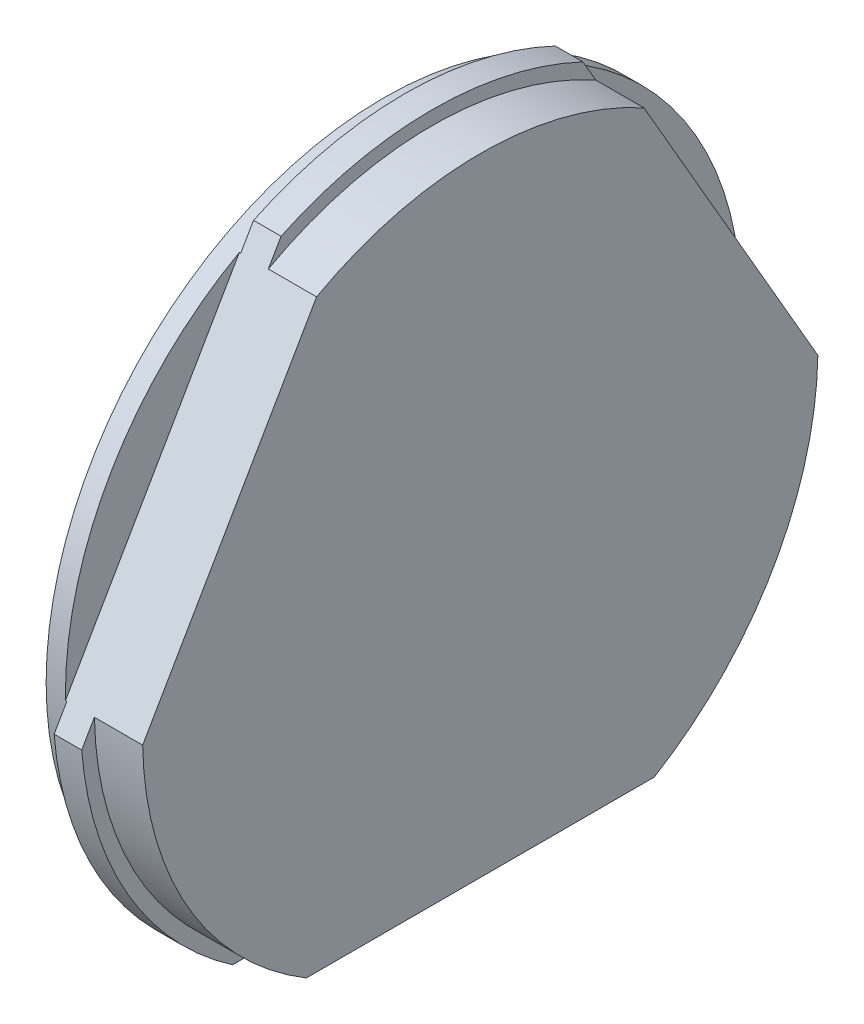
ISO-10303-21;
HEADER;
FILE_DESCRIPTION(('STEP AP214'),'2;1');
FILE_NAME('part.step','',(''),(''),'','','');
FILE_SCHEMA(('AUTOMOTIVE_DESIGN { 1 0 10303 214 1 1 1 1 }'));
ENDSEC;
DATA;
#1=APPLICATION_CONTEXT('core data for automotive mechanical design processes');
#2=APPLICATION_PROTOCOL_DEFINITION('international standard','automotive_design',2000,#1);
#3=PRODUCT_CONTEXT('',#1,'mechanical');
#4=PRODUCT('Part','Part','',(#3));
#5=PRODUCT_RELATED_PRODUCT_CATEGORY('part','',(#4));
#6=PRODUCT_DEFINITION_FORMATION('','',#4);
#7=PRODUCT_DEFINITION_CONTEXT('part definition',#1,'design');
#8=PRODUCT_DEFINITION('design','',#6,#7);
#9=PRODUCT_DEFINITION_SHAPE('','',#8);
#10=(LENGTH_UNIT() NAMED_UNIT(*) SI_UNIT(.MILLI.,.METRE.));
#11=(NAMED_UNIT(*) PLANE_ANGLE_UNIT() SI_UNIT($,.RADIAN.));
#12=(NAMED_UNIT(*) SI_UNIT($,.STERADIAN.) SOLID_ANGLE_UNIT());
#13=UNCERTAINTY_MEASURE_WITH_UNIT(LENGTH_MEASURE(1.E-05),#10,'distance_accuracy_value','');
#14=(GEOMETRIC_REPRESENTATION_CONTEXT(3) GLOBAL_UNCERTAINTY_ASSIGNED_CONTEXT((#13)) GLOBAL_UNIT_ASSIGNED_CONTEXT((#10,
#11,#12)) REPRESENTATION_CONTEXT('',''));
#15=CARTESIAN_POINT('',(0.,0.,0.));
#16=DIRECTION('',(0.,0.,1.));
#17=DIRECTION('',(1.,0.,0.));
#18=AXIS2_PLACEMENT_3D('',#15,#16,#17);
#19=CARTESIAN_POINT('',(0.,24.5,0.));
#20=DIRECTION('',(1.,0.,0.));
#21=DIRECTION('',(0.,0.,-1.));
#22=AXIS2_PLACEMENT_3D('',#19,#20,#21);
#23=PLANE('',#22);
#24=CARTESIAN_POINT('',(0.,0.,0.));
#25=DIRECTION('',(-1.,0.,0.));
#26=DIRECTION('',(0.,0.,1.));
#27=AXIS2_PLACEMENT_3D('',#24,#25,#26);
#28=CIRCLE('',#27,25.5);
#29=CARTESIAN_POINT('',(0.,23.0274698163675,10.9537954087286));
#30=VERTEX_POINT('',#29);
#31=CARTESIAN_POINT('',(0.,23.0274698163676,-10.9537954087284));
#32=VERTEX_POINT('',#31);
#33=EDGE_CURVE('E255',#30,#32,#28,.T.);
#34=ORIENTED_EDGE('',*,*,#33,.T.);
#35=DIRECTION('',(0.,-0.866025403784436,-0.500000000000004));
#36=VECTOR('',#35,1.);
#37=CARTESIAN_POINT('',(0.,28.875,-7.57772228311372));
#38=LINE('',#37,#36);
#39=CARTESIAN_POINT('',(0.,21.4287464971973,-11.8768187474111));
#40=VERTEX_POINT('',#39);
#41=EDGE_CURVE('E168',#32,#40,#38,.T.);
#42=ORIENTED_EDGE('',*,*,#41,.T.);
#43=CARTESIAN_POINT('',(0.,0.,0.));
#44=DIRECTION('',(-1.,0.,0.));
#45=DIRECTION('',(0.,0.,1.));
#46=AXIS2_PLACEMENT_3D('',#43,#44,#45);
#47=CIRCLE('',#46,24.5);
#48=CARTESIAN_POINT('',(0.,21.4287464971972,11.8768187474113));
#49=VERTEX_POINT('',#48);
#50=EDGE_CURVE('E181',#49,#40,#47,.T.);
#51=ORIENTED_EDGE('',*,*,#50,.F.);
#52=DIRECTION('',(0.,0.86602540378444,-0.499999999999998));
#53=VECTOR('',#52,1.);
#54=CARTESIAN_POINT('',(0.,28.875,7.5777222831139));
#55=LINE('',#54,#53);
#56=EDGE_CURVE('E231',#49,#30,#55,.T.);
#57=ORIENTED_EDGE('',*,*,#56,.T.);
#58=EDGE_LOOP('',(#34,#42,#51,#57));
#59=FACE_BOUND('',#58,.T.);
#60=ADVANCED_FACE('F33',(#59),#23,.F.);
#61=CARTESIAN_POINT('',(-6.56495625261606,0.,0.));
#62=DIRECTION('',(-1.,0.,0.));
#63=DIRECTION('',(0.,0.,1.));
#64=AXIS2_PLACEMENT_3D('',#61,#62,#63);
#65=CYLINDRICAL_SURFACE('',#64,25.5);
#66=CARTESIAN_POINT('',(2.,0.,0.));
#67=DIRECTION('',(-1.,0.,0.));
#68=DIRECTION('',(0.,0.,1.));
#69=AXIS2_PLACEMENT_3D('',#66,#67,#68);
#70=CIRCLE('',#69,25.5);
#71=CARTESIAN_POINT('',(2.,23.0274698163675,10.9537954087286));
#72=VERTEX_POINT('',#71);
#73=CARTESIAN_POINT('',(2.,23.0274698163676,-10.9537954087284));
#74=VERTEX_POINT('',#73);
#75=EDGE_CURVE('E250',#72,#74,#70,.T.);
#76=ORIENTED_EDGE('',*,*,#75,.T.);
#77=DIRECTION('',(1.,0.,0.));
#78=VECTOR('',#77,1.);
#79=CARTESIAN_POINT('',(-29.4788319439147,23.0274698163676,-10.9537954087284));
#80=LINE('',#79,#78);
#81=EDGE_CURVE('E173',#32,#74,#80,.T.);
#82=ORIENTED_EDGE('',*,*,#81,.F.);
#83=ORIENTED_EDGE('',*,*,#33,.F.);
#84=DIRECTION('',(1.,0.,0.));
#85=VECTOR('',#84,1.);
#86=CARTESIAN_POINT('',(-29.4788319439147,23.0274698163675,10.9537954087286));
#87=LINE('',#86,#85);
#88=EDGE_CURVE('E213',#30,#72,#87,.T.);
#89=ORIENTED_EDGE('',*,*,#88,.T.);
#90=EDGE_LOOP('',(#76,#82,#83,#89));
#91=FACE_BOUND('',#90,.T.);
#92=ADVANCED_FACE('F297',(#91),#65,.T.);
#93=CARTESIAN_POINT('',(2.,25.5,0.));
#94=DIRECTION('',(-1.,0.,0.));
#95=DIRECTION('',(0.,0.,1.));
#96=AXIS2_PLACEMENT_3D('',#93,#94,#95);
#97=PLANE('',#96);
#98=CARTESIAN_POINT('',(2.,-2.02746981636741,-25.4192715502179));
#99=VERTEX_POINT('',#98);
#100=CARTESIAN_POINT('',(2.,-21.,-14.4654761414894));
#101=VERTEX_POINT('',#100);
#102=EDGE_CURVE('E254',#99,#101,#70,.T.);
#103=ORIENTED_EDGE('',*,*,#102,.F.);
#104=DIRECTION('',(0.,0.866025403784436,0.500000000000004));
#105=VECTOR('',#104,1.);
#106=CARTESIAN_POINT('',(2.,29.625,-7.1447095812215));
#107=LINE('',#106,#105);
#108=CARTESIAN_POINT('',(2.,-0.428746497197072,-24.4962482115352));
#109=VERTEX_POINT('',#108);
#110=EDGE_CURVE('E306',#99,#109,#107,.T.);
#111=ORIENTED_EDGE('',*,*,#110,.T.);
#112=CARTESIAN_POINT('',(2.,0.,0.));
#113=DIRECTION('',(-1.,0.,0.));
#114=DIRECTION('',(0.,0.,1.));
#115=AXIS2_PLACEMENT_3D('',#112,#113,#114);
#116=CIRCLE('',#115,24.5);
#117=CARTESIAN_POINT('',(2.,-21.,-12.619429464124));
#118=VERTEX_POINT('',#117);
#119=EDGE_CURVE('E249',#109,#118,#116,.T.);
#120=ORIENTED_EDGE('',*,*,#119,.T.);
#121=DIRECTION('',(0.,0.,1.));
#122=VECTOR('',#121,1.);
#123=CARTESIAN_POINT('',(2.,-21.,0.));
#124=LINE('',#123,#122);
#125=EDGE_CURVE('E197',#101,#118,#124,.T.);
#126=ORIENTED_EDGE('',*,*,#125,.F.);
#127=EDGE_LOOP('',(#103,#111,#120,#126));
#128=FACE_BOUND('',#127,.T.);
#129=ADVANCED_FACE('F336',(#128),#97,.F.);
#130=CARTESIAN_POINT('',(-6.56495625261606,0.,0.));
#131=DIRECTION('',(-1.,0.,0.));
#132=DIRECTION('',(0.,0.,1.));
#133=AXIS2_PLACEMENT_3D('',#130,#131,#132);
#134=CYLINDRICAL_SURFACE('',#133,24.5);
#135=CARTESIAN_POINT('',(5.5,0.,0.));
#136=DIRECTION('',(-1.,0.,0.));
#137=DIRECTION('',(0.,0.,1.));
#138=AXIS2_PLACEMENT_3D('',#135,#136,#137);
#139=CIRCLE('',#138,24.5);
#140=CARTESIAN_POINT('',(5.5,21.4287464971972,11.8768187474113));
#141=VERTEX_POINT('',#140);
#142=CARTESIAN_POINT('',(5.5,21.4287464971973,-11.8768187474111));
#143=VERTEX_POINT('',#142);
#144=EDGE_CURVE('E241',#141,#143,#139,.T.);
#145=ORIENTED_EDGE('',*,*,#144,.T.);
#146=DIRECTION('',(-1.,0.,0.));
#147=VECTOR('',#146,1.);
#148=CARTESIAN_POINT('',(-6.56495625261606,21.4287464971973,-11.8768187474111));
#149=LINE('',#148,#147);
#150=CARTESIAN_POINT('',(2.,21.4287464971973,-11.8768187474111));
#151=VERTEX_POINT('',#150);
#152=EDGE_CURVE('E48',#143,#151,#149,.T.);
#153=ORIENTED_EDGE('',*,*,#152,.T.);
#154=CARTESIAN_POINT('',(2.,21.4287464971972,11.8768187474113));
#155=VERTEX_POINT('',#154);
#156=EDGE_CURVE('E245',#155,#151,#116,.T.);
#157=ORIENTED_EDGE('',*,*,#156,.F.);
#158=DIRECTION('',(-1.,0.,0.));
#159=VECTOR('',#158,1.);
#160=CARTESIAN_POINT('',(-6.56495625261606,21.4287464971972,11.8768187474113));
#161=LINE('',#160,#159);
#162=EDGE_CURVE('E221',#155,#141,#161,.F.);
#163=ORIENTED_EDGE('',*,*,#162,.T.);
#164=EDGE_LOOP('',(#145,#153,#157,#163));
#165=FACE_BOUND('',#164,.T.);
#166=ADVANCED_FACE('F284',(#165),#134,.T.);
#167=CARTESIAN_POINT('',(-6.56495625261606,0.,0.));
#168=DIRECTION('',(-1.,0.,0.));
#169=DIRECTION('',(0.,0.,1.));
#170=AXIS2_PLACEMENT_3D('',#167,#168,#169);
#171=CYLINDRICAL_SURFACE('',#170,24.5);
#172=ORIENTED_EDGE('',*,*,#50,.T.);
#173=DIRECTION('',(-1.,0.,0.));
#174=VECTOR('',#173,1.);
#175=CARTESIAN_POINT('',(-6.56495625261606,21.4287464971973,-11.8768187474111));
#176=LINE('',#175,#174);
#177=CARTESIAN_POINT('',(-0.1,21.4287464971973,-11.8768187474111));
#178=VERTEX_POINT('',#177);
#179=EDGE_CURVE('E178',#40,#178,#176,.T.);
#180=ORIENTED_EDGE('',*,*,#179,.T.);
#181=CARTESIAN_POINT('',(-0.1,0.,0.));
#182=DIRECTION('',(1.,0.,0.));
#183=DIRECTION('',(0.,0.,-1.));
#184=AXIS2_PLACEMENT_3D('',#181,#182,#183);
#185=CIRCLE('',#184,24.5);
#186=CARTESIAN_POINT('',(-0.1,-0.428746497197072,-24.4962482115352));
#187=VERTEX_POINT('',#186);
#188=EDGE_CURVE('E12',#187,#178,#185,.T.);
#189=ORIENTED_EDGE('',*,*,#188,.F.);
#190=DIRECTION('',(-1.,0.,0.));
#191=VECTOR('',#190,1.);
#192=CARTESIAN_POINT('',(-6.56495625261606,-0.428746497197072,-24.4962482115352));
#193=LINE('',#192,#191);
#194=CARTESIAN_POINT('',(0.,-0.428746497197065,-24.4962482115352));
#195=VERTEX_POINT('',#194);
#196=EDGE_CURVE('E158',#187,#195,#193,.F.);
#197=ORIENTED_EDGE('',*,*,#196,.T.);
#198=CARTESIAN_POINT('',(0.,-21.,-12.619429464124));
#199=VERTEX_POINT('',#198);
#200=EDGE_CURVE('E262',#195,#199,#47,.T.);
#201=ORIENTED_EDGE('',*,*,#200,.T.);
#202=DIRECTION('',(-1.,0.,0.));
#203=VECTOR('',#202,1.);
#204=CARTESIAN_POINT('',(-6.56495625261606,-21.,-12.619429464124));
#205=LINE('',#204,#203);
#206=CARTESIAN_POINT('',(-0.1,-21.,-12.619429464124));
#207=VERTEX_POINT('',#206);
#208=EDGE_CURVE('E206',#207,#199,#205,.F.);
#209=ORIENTED_EDGE('',*,*,#208,.F.);
#210=CARTESIAN_POINT('',(-0.1,0.,0.));
#211=DIRECTION('',(1.,0.,0.));
#212=DIRECTION('',(0.,0.,-1.));
#213=AXIS2_PLACEMENT_3D('',#210,#211,#212);
#214=CIRCLE('',#213,24.5);
#215=CARTESIAN_POINT('',(-0.1,-21.,12.619429464124));
#216=VERTEX_POINT('',#215);
#217=EDGE_CURVE('E278',#216,#207,#214,.T.);
#218=ORIENTED_EDGE('',*,*,#217,.F.);
#219=DIRECTION('',(-1.,0.,0.));
#220=VECTOR('',#219,1.);
#221=CARTESIAN_POINT('',(-6.56495625261606,-21.,12.619429464124));
#222=LINE('',#221,#220);
#223=CARTESIAN_POINT('',(0.,-21.,12.619429464124));
#224=VERTEX_POINT('',#223);
#225=EDGE_CURVE('E210',#224,#216,#222,.T.);
#226=ORIENTED_EDGE('',*,*,#225,.F.);
#227=CARTESIAN_POINT('',(0.,-0.428746497197253,24.4962482115352));
#228=VERTEX_POINT('',#227);
#229=EDGE_CURVE('E258',#224,#228,#47,.T.);
#230=ORIENTED_EDGE('',*,*,#229,.T.);
#231=DIRECTION('',(-1.,0.,0.));
#232=VECTOR('',#231,1.);
#233=CARTESIAN_POINT('',(-6.56495625261606,-0.428746497197255,24.4962482115352));
#234=LINE('',#233,#232);
#235=CARTESIAN_POINT('',(-0.1,-0.428746497197261,24.4962482115352));
#236=VERTEX_POINT('',#235);
#237=EDGE_CURVE('E237',#228,#236,#234,.T.);
#238=ORIENTED_EDGE('',*,*,#237,.T.);
#239=CARTESIAN_POINT('',(-0.1,0.,0.));
#240=DIRECTION('',(1.,0.,0.));
#241=DIRECTION('',(0.,0.,-1.));
#242=AXIS2_PLACEMENT_3D('',#239,#240,#241);
#243=CIRCLE('',#242,24.5);
#244=CARTESIAN_POINT('',(-0.1,21.4287464971972,11.8768187474113));
#245=VERTEX_POINT('',#244);
#246=EDGE_CURVE('E274',#245,#236,#243,.T.);
#247=ORIENTED_EDGE('',*,*,#246,.F.);
#248=DIRECTION('',(-1.,0.,0.));
#249=VECTOR('',#248,1.);
#250=CARTESIAN_POINT('',(-6.56495625261606,21.4287464971972,11.8768187474113));
#251=LINE('',#250,#249);
#252=EDGE_CURVE('E234',#245,#49,#251,.F.);
#253=ORIENTED_EDGE('',*,*,#252,.T.);
#254=EDGE_LOOP('',(#172,#180,#189,#197,#201,#209,#218,#226,#230,#238,#247,#253));
#255=FACE_BOUND('',#254,.T.);
#256=CARTESIAN_POINT('',(-1.5,0.,0.));
#257=DIRECTION('',(-1.,0.,0.));
#258=DIRECTION('',(0.,0.,1.));
#259=AXIS2_PLACEMENT_3D('',#256,#257,#258);
#260=CIRCLE('',#259,24.5);
#261=CARTESIAN_POINT('',(-1.5,0.,24.5));
#262=VERTEX_POINT('',#261);
#263=EDGE_CURVE('E261',#262,#262,#260,.T.);
#264=ORIENTED_EDGE('',*,*,#263,.F.);
#265=EDGE_LOOP('',(#264));
#266=FACE_BOUND('',#265,.T.);
#267=ADVANCED_FACE('F176',(#255,#266),#171,.T.);
#268=DIRECTION('',(0.,0.,-1.));
#269=VECTOR('',#268,1.);
#270=CARTESIAN_POINT('',(0.,-21.,0.));
#271=LINE('',#270,#269);
#272=CARTESIAN_POINT('',(0.,-21.,14.4654761414894));
#273=VERTEX_POINT('',#272);
#274=EDGE_CURVE('E207',#273,#224,#271,.T.);
#275=ORIENTED_EDGE('',*,*,#274,.F.);
#276=CARTESIAN_POINT('',(0.,-2.02746981636761,25.4192715502179));
#277=VERTEX_POINT('',#276);
#278=EDGE_CURVE('E253',#273,#277,#28,.T.);
#279=ORIENTED_EDGE('',*,*,#278,.T.);
#280=EDGE_CURVE('E235',#277,#228,#55,.T.);
#281=ORIENTED_EDGE('',*,*,#280,.T.);
#282=ORIENTED_EDGE('',*,*,#229,.F.);
#283=EDGE_LOOP('',(#275,#279,#281,#282));
#284=FACE_BOUND('',#283,.T.);
#285=ADVANCED_FACE('F321',(#284),#23,.F.);
#286=ORIENTED_EDGE('',*,*,#200,.F.);
#287=CARTESIAN_POINT('',(0.,-2.02746981636741,-25.4192715502179));
#288=VERTEX_POINT('',#287);
#289=EDGE_CURVE('E164',#195,#288,#38,.T.);
#290=ORIENTED_EDGE('',*,*,#289,.T.);
#291=CARTESIAN_POINT('',(0.,-21.,-14.4654761414894));
#292=VERTEX_POINT('',#291);
#293=EDGE_CURVE('E259',#288,#292,#28,.T.);
#294=ORIENTED_EDGE('',*,*,#293,.T.);
#295=EDGE_CURVE('E203',#199,#292,#271,.T.);
#296=ORIENTED_EDGE('',*,*,#295,.F.);
#297=EDGE_LOOP('',(#286,#290,#294,#296));
#298=FACE_BOUND('',#297,.T.);
#299=ADVANCED_FACE('F311',(#298),#23,.F.);
#300=DIRECTION('',(1.,0.,0.));
#301=VECTOR('',#300,1.);
#302=CARTESIAN_POINT('',(-29.4788319439147,-21.,14.4654761414894));
#303=LINE('',#302,#301);
#304=CARTESIAN_POINT('',(2.,-21.,14.4654761414894));
#305=VERTEX_POINT('',#304);
#306=EDGE_CURVE('E183',#273,#305,#303,.T.);
#307=ORIENTED_EDGE('',*,*,#306,.T.);
#308=CARTESIAN_POINT('',(2.,-2.02746981636761,25.4192715502179));
#309=VERTEX_POINT('',#308);
#310=EDGE_CURVE('E248',#305,#309,#70,.T.);
#311=ORIENTED_EDGE('',*,*,#310,.T.);
#312=DIRECTION('',(1.,0.,0.));
#313=VECTOR('',#312,1.);
#314=CARTESIAN_POINT('',(-29.4788319439147,-2.02746981636761,25.4192715502179));
#315=LINE('',#314,#313);
#316=EDGE_CURVE('E212',#277,#309,#315,.T.);
#317=ORIENTED_EDGE('',*,*,#316,.F.);
#318=ORIENTED_EDGE('',*,*,#278,.F.);
#319=EDGE_LOOP('',(#307,#311,#317,#318));
#320=FACE_BOUND('',#319,.T.);
#321=ADVANCED_FACE('F328',(#320),#65,.T.);
#322=ORIENTED_EDGE('',*,*,#293,.F.);
#323=DIRECTION('',(1.,0.,0.));
#324=VECTOR('',#323,1.);
#325=CARTESIAN_POINT('',(-29.4788319439147,-2.02746981636741,-25.4192715502179));
#326=LINE('',#325,#324);
#327=EDGE_CURVE('E300',#288,#99,#326,.T.);
#328=ORIENTED_EDGE('',*,*,#327,.T.);
#329=ORIENTED_EDGE('',*,*,#102,.T.);
#330=DIRECTION('',(1.,0.,0.));
#331=VECTOR('',#330,1.);
#332=CARTESIAN_POINT('',(-29.4788319439147,-21.,-14.4654761414894));
#333=LINE('',#332,#331);
#334=EDGE_CURVE('E186',#292,#101,#333,.T.);
#335=ORIENTED_EDGE('',*,*,#334,.F.);
#336=EDGE_LOOP('',(#322,#328,#329,#335));
#337=FACE_BOUND('',#336,.T.);
#338=ADVANCED_FACE('F315',(#337),#65,.T.);
#339=ORIENTED_EDGE('',*,*,#156,.T.);
#340=EDGE_CURVE('E294',#151,#74,#107,.T.);
#341=ORIENTED_EDGE('',*,*,#340,.T.);
#342=ORIENTED_EDGE('',*,*,#75,.F.);
#343=DIRECTION('',(0.,-0.86602540378444,0.499999999999998));
#344=VECTOR('',#343,1.);
#345=CARTESIAN_POINT('',(2.,29.625,7.14470958122168));
#346=LINE('',#345,#344);
#347=EDGE_CURVE('E224',#72,#155,#346,.T.);
#348=ORIENTED_EDGE('',*,*,#347,.T.);
#349=EDGE_LOOP('',(#339,#341,#342,#348));
#350=FACE_BOUND('',#349,.T.);
#351=ADVANCED_FACE('F292',(#350),#97,.F.);
#352=CARTESIAN_POINT('',(2.,-21.,12.619429464124));
#353=VERTEX_POINT('',#352);
#354=EDGE_CURVE('E201',#353,#305,#124,.T.);
#355=ORIENTED_EDGE('',*,*,#354,.F.);
#356=CARTESIAN_POINT('',(2.,-0.428746497197255,24.4962482115352));
#357=VERTEX_POINT('',#356);
#358=EDGE_CURVE('E244',#353,#357,#116,.T.);
#359=ORIENTED_EDGE('',*,*,#358,.T.);
#360=EDGE_CURVE('E228',#357,#309,#346,.T.);
#361=ORIENTED_EDGE('',*,*,#360,.T.);
#362=ORIENTED_EDGE('',*,*,#310,.F.);
#363=EDGE_LOOP('',(#355,#359,#361,#362));
#364=FACE_BOUND('',#363,.T.);
#365=ADVANCED_FACE('F339',(#364),#97,.F.);
#366=DIRECTION('',(-1.,0.,0.));
#367=VECTOR('',#366,1.);
#368=CARTESIAN_POINT('',(-6.56495625261606,-21.,12.619429464124));
#369=LINE('',#368,#367);
#370=CARTESIAN_POINT('',(5.5,-21.,12.619429464124));
#371=VERTEX_POINT('',#370);
#372=EDGE_CURVE('E200',#371,#353,#369,.T.);
#373=ORIENTED_EDGE('',*,*,#372,.F.);
#374=CARTESIAN_POINT('',(5.5,-0.428746497197253,24.4962482115352));
#375=VERTEX_POINT('',#374);
#376=EDGE_CURVE('E240',#371,#375,#139,.T.);
#377=ORIENTED_EDGE('',*,*,#376,.T.);
#378=DIRECTION('',(-1.,0.,0.));
#379=VECTOR('',#378,1.);
#380=CARTESIAN_POINT('',(-6.56495625261606,-0.428746497197255,24.4962482115352));
#381=LINE('',#380,#379);
#382=EDGE_CURVE('E227',#375,#357,#381,.T.);
#383=ORIENTED_EDGE('',*,*,#382,.T.);
#384=ORIENTED_EDGE('',*,*,#358,.F.);
#385=EDGE_LOOP('',(#373,#377,#383,#384));
#386=FACE_BOUND('',#385,.T.);
#387=ADVANCED_FACE('F342',(#386),#134,.T.);
#388=ORIENTED_EDGE('',*,*,#119,.F.);
#389=DIRECTION('',(-1.,0.,0.));
#390=VECTOR('',#389,1.);
#391=CARTESIAN_POINT('',(-6.56495625261606,-0.428746497197072,-24.4962482115352));
#392=LINE('',#391,#390);
#393=CARTESIAN_POINT('',(5.5,-0.428746497197067,-24.4962482115352));
#394=VERTEX_POINT('',#393);
#395=EDGE_CURVE('E172',#109,#394,#392,.F.);
#396=ORIENTED_EDGE('',*,*,#395,.T.);
#397=CARTESIAN_POINT('',(5.5,-21.,-12.619429464124));
#398=VERTEX_POINT('',#397);
#399=EDGE_CURVE('E56',#394,#398,#139,.T.);
#400=ORIENTED_EDGE('',*,*,#399,.T.);
#401=DIRECTION('',(-1.,0.,0.));
#402=VECTOR('',#401,1.);
#403=CARTESIAN_POINT('',(-6.56495625261606,-21.,-12.619429464124));
#404=LINE('',#403,#402);
#405=EDGE_CURVE('E193',#118,#398,#404,.F.);
#406=ORIENTED_EDGE('',*,*,#405,.F.);
#407=EDGE_LOOP('',(#388,#396,#400,#406));
#408=FACE_BOUND('',#407,.T.);
#409=ADVANCED_FACE('F344',(#408),#134,.T.);
#410=CARTESIAN_POINT('',(5.5,24.5,0.));
#411=DIRECTION('',(-1.,0.,0.));
#412=DIRECTION('',(0.,0.,1.));
#413=AXIS2_PLACEMENT_3D('',#410,#411,#412);
#414=PLANE('',#413);
#415=ORIENTED_EDGE('',*,*,#399,.F.);
#416=DIRECTION('',(0.,0.866025403784436,0.500000000000004));
#417=VECTOR('',#416,1.);
#418=CARTESIAN_POINT('',(5.5,28.875,-7.57772228311372));
#419=LINE('',#418,#417);
#420=EDGE_CURVE('E41',#394,#143,#419,.T.);
#421=ORIENTED_EDGE('',*,*,#420,.T.);
#422=ORIENTED_EDGE('',*,*,#144,.F.);
#423=DIRECTION('',(0.,-0.86602540378444,0.499999999999998));
#424=VECTOR('',#423,1.);
#425=CARTESIAN_POINT('',(5.5,28.875,7.5777222831139));
#426=LINE('',#425,#424);
#427=EDGE_CURVE('E271',#141,#375,#426,.T.);
#428=ORIENTED_EDGE('',*,*,#427,.T.);
#429=ORIENTED_EDGE('',*,*,#376,.F.);
#430=DIRECTION('',(0.,0.,1.));
#431=VECTOR('',#430,1.);
#432=CARTESIAN_POINT('',(5.5,-21.,0.));
#433=LINE('',#432,#431);
#434=EDGE_CURVE('E276',#398,#371,#433,.T.);
#435=ORIENTED_EDGE('',*,*,#434,.F.);
#436=EDGE_LOOP('',(#415,#421,#422,#428,#429,#435));
#437=FACE_BOUND('',#436,.T.);
#438=ADVANCED_FACE('F281',(#437),#414,.F.);
#439=CARTESIAN_POINT('',(4.,20.,0.));
#440=DIRECTION('',(1.,0.,0.));
#441=DIRECTION('',(0.,0.,-1.));
#442=AXIS2_PLACEMENT_3D('',#439,#440,#441);
#443=PLANE('',#442);
#444=CARTESIAN_POINT('',(4.,0.,0.));
#445=DIRECTION('',(-1.,0.,0.));
#446=DIRECTION('',(0.,0.,1.));
#447=AXIS2_PLACEMENT_3D('',#444,#445,#446);
#448=CIRCLE('',#447,20.);
#449=CARTESIAN_POINT('',(4.,0.,20.));
#450=VERTEX_POINT('',#449);
#451=EDGE_CURVE('E268',#450,#450,#448,.T.);
#452=ORIENTED_EDGE('',*,*,#451,.T.);
#453=EDGE_LOOP('',(#452));
#454=FACE_BOUND('',#453,.T.);
#455=ADVANCED_FACE('F35',(#454),#443,.F.);
#456=CARTESIAN_POINT('',(-6.56495625261606,0.,0.));
#457=DIRECTION('',(-1.,0.,0.));
#458=DIRECTION('',(0.,0.,1.));
#459=AXIS2_PLACEMENT_3D('',#456,#457,#458);
#460=CYLINDRICAL_SURFACE('',#459,20.);
#461=ORIENTED_EDGE('',*,*,#451,.F.);
#462=EDGE_LOOP('',(#461));
#463=FACE_BOUND('',#462,.T.);
#464=CARTESIAN_POINT('',(-1.5,0.,0.));
#465=DIRECTION('',(-1.,0.,0.));
#466=DIRECTION('',(0.,0.,1.));
#467=AXIS2_PLACEMENT_3D('',#464,#465,#466);
#468=CIRCLE('',#467,20.);
#469=CARTESIAN_POINT('',(-1.5,0.,20.));
#470=VERTEX_POINT('',#469);
#471=EDGE_CURVE('E265',#470,#470,#468,.T.);
#472=ORIENTED_EDGE('',*,*,#471,.T.);
#473=EDGE_LOOP('',(#472));
#474=FACE_BOUND('',#473,.T.);
#475=ADVANCED_FACE('F372',(#463,#474),#460,.F.);
#476=CARTESIAN_POINT('',(-1.5,24.5,0.));
#477=DIRECTION('',(1.,0.,0.));
#478=DIRECTION('',(0.,0.,-1.));
#479=AXIS2_PLACEMENT_3D('',#476,#477,#478);
#480=PLANE('',#479);
#481=ORIENTED_EDGE('',*,*,#471,.F.);
#482=EDGE_LOOP('',(#481));
#483=FACE_BOUND('',#482,.T.);
#484=ORIENTED_EDGE('',*,*,#263,.T.);
#485=EDGE_LOOP('',(#484));
#486=FACE_BOUND('',#485,.T.);
#487=ADVANCED_FACE('F369',(#483,#486),#480,.F.);
#488=CARTESIAN_POINT('',(-0.1,24.5,0.));
#489=DIRECTION('',(1.,0.,0.));
#490=DIRECTION('',(0.,0.,-1.));
#491=AXIS2_PLACEMENT_3D('',#488,#489,#490);
#492=PLANE('',#491);
#493=ORIENTED_EDGE('',*,*,#246,.T.);
#494=DIRECTION('',(0.,-0.86602540378444,0.499999999999998));
#495=VECTOR('',#494,1.);
#496=CARTESIAN_POINT('',(-0.0999999999999994,34.853249819723,4.12617814041404));
#497=LINE('',#496,#495);
#498=EDGE_CURVE('E216',#245,#236,#497,.T.);
#499=ORIENTED_EDGE('',*,*,#498,.F.);
#500=EDGE_LOOP('',(#493,#499));
#501=FACE_BOUND('',#500,.T.);
#502=ADVANCED_FACE('F371',(#501),#492,.T.);
#503=CARTESIAN_POINT('',(-29.4788319439147,34.853249819723,4.12617814041404));
#504=DIRECTION('',(0.,-0.499999999999998,-0.86602540378444));
#505=DIRECTION('',(0.,0.86602540378444,-0.499999999999998));
#506=AXIS2_PLACEMENT_3D('',#503,#504,#505);
#507=PLANE('',#506);
#508=ORIENTED_EDGE('',*,*,#280,.F.);
#509=ORIENTED_EDGE('',*,*,#316,.T.);
#510=ORIENTED_EDGE('',*,*,#360,.F.);
#511=ORIENTED_EDGE('',*,*,#382,.F.);
#512=ORIENTED_EDGE('',*,*,#427,.F.);
#513=ORIENTED_EDGE('',*,*,#162,.F.);
#514=ORIENTED_EDGE('',*,*,#347,.F.);
#515=ORIENTED_EDGE('',*,*,#88,.F.);
#516=ORIENTED_EDGE('',*,*,#56,.F.);
#517=ORIENTED_EDGE('',*,*,#252,.F.);
#518=ORIENTED_EDGE('',*,*,#498,.T.);
#519=ORIENTED_EDGE('',*,*,#237,.F.);
#520=EDGE_LOOP('',(#508,#509,#510,#511,#512,#513,#514,#515,#516,#517,#518,#519));
#521=FACE_BOUND('',#520,.T.);
#522=ADVANCED_FACE('F288',(#521),#507,.F.);
#523=CARTESIAN_POINT('',(-0.1,24.5,0.));
#524=DIRECTION('',(1.,0.,0.));
#525=DIRECTION('',(0.,0.,-1.));
#526=AXIS2_PLACEMENT_3D('',#523,#524,#525);
#527=PLANE('',#526);
#528=ORIENTED_EDGE('',*,*,#217,.T.);
#529=DIRECTION('',(0.,0.,1.));
#530=VECTOR('',#529,1.);
#531=CARTESIAN_POINT('',(-0.0999999999999994,-21.,-56.2414213562373));
#532=LINE('',#531,#530);
#533=EDGE_CURVE('E190',#207,#216,#532,.T.);
#534=ORIENTED_EDGE('',*,*,#533,.T.);
#535=EDGE_LOOP('',(#528,#534));
#536=FACE_BOUND('',#535,.T.);
#537=ADVANCED_FACE('F414',(#536),#527,.T.);
#538=CARTESIAN_POINT('',(-29.4788319439147,-21.,-56.2414213562373));
#539=DIRECTION('',(0.,-1.,0.));
#540=DIRECTION('',(0.,0.,-1.));
#541=AXIS2_PLACEMENT_3D('',#538,#539,#540);
#542=PLANE('',#541);
#543=ORIENTED_EDGE('',*,*,#225,.T.);
#544=ORIENTED_EDGE('',*,*,#533,.F.);
#545=ORIENTED_EDGE('',*,*,#208,.T.);
#546=ORIENTED_EDGE('',*,*,#295,.T.);
#547=ORIENTED_EDGE('',*,*,#334,.T.);
#548=ORIENTED_EDGE('',*,*,#125,.T.);
#549=ORIENTED_EDGE('',*,*,#405,.T.);
#550=ORIENTED_EDGE('',*,*,#434,.T.);
#551=ORIENTED_EDGE('',*,*,#372,.T.);
#552=ORIENTED_EDGE('',*,*,#354,.T.);
#553=ORIENTED_EDGE('',*,*,#306,.F.);
#554=ORIENTED_EDGE('',*,*,#274,.T.);
#555=EDGE_LOOP('',(#543,#544,#545,#546,#547,#548,#549,#550,#551,#552,#553,#554));
#556=FACE_BOUND('',#555,.T.);
#557=ADVANCED_FACE('F335',(#556),#542,.T.);
#558=CARTESIAN_POINT('',(-0.1,24.5,0.));
#559=DIRECTION('',(1.,0.,0.));
#560=DIRECTION('',(0.,0.,-1.));
#561=AXIS2_PLACEMENT_3D('',#558,#559,#560);
#562=PLANE('',#561);
#563=ORIENTED_EDGE('',*,*,#188,.T.);
#564=DIRECTION('',(0.,0.866025403784436,0.500000000000004));
#565=VECTOR('',#564,1.);
#566=CARTESIAN_POINT('',(-0.0999999999999994,-13.8532498197231,-32.2468888185327));
#567=LINE('',#566,#565);
#568=EDGE_CURVE('E161',#187,#178,#567,.T.);
#569=ORIENTED_EDGE('',*,*,#568,.F.);
#570=EDGE_LOOP('',(#563,#569));
#571=FACE_BOUND('',#570,.T.);
#572=ADVANCED_FACE('F171',(#571),#562,.T.);
#573=CARTESIAN_POINT('',(-29.4788319439147,-13.8532498197231,-32.2468888185327));
#574=DIRECTION('',(0.,-0.500000000000004,0.866025403784436));
#575=DIRECTION('',(0.,-0.866025403784436,-0.500000000000004));
#576=AXIS2_PLACEMENT_3D('',#573,#574,#575);
#577=PLANE('',#576);
#578=ORIENTED_EDGE('',*,*,#41,.F.);
#579=ORIENTED_EDGE('',*,*,#81,.T.);
#580=ORIENTED_EDGE('',*,*,#340,.F.);
#581=ORIENTED_EDGE('',*,*,#152,.F.);
#582=ORIENTED_EDGE('',*,*,#420,.F.);
#583=ORIENTED_EDGE('',*,*,#395,.F.);
#584=ORIENTED_EDGE('',*,*,#110,.F.);
#585=ORIENTED_EDGE('',*,*,#327,.F.);
#586=ORIENTED_EDGE('',*,*,#289,.F.);
#587=ORIENTED_EDGE('',*,*,#196,.F.);
#588=ORIENTED_EDGE('',*,*,#568,.T.);
#589=ORIENTED_EDGE('',*,*,#179,.F.);
#590=EDGE_LOOP('',(#578,#579,#580,#581,#582,#583,#584,#585,#586,#587,#588,#589));
#591=FACE_BOUND('',#590,.T.);
#592=ADVANCED_FACE('F160',(#591),#577,.F.);
#593=CLOSED_SHELL('',(#60,#92,#129,#166,#267,#285,#299,#321,#338,#351,#365,#387,#409,#438,#455,
#475,#487,#502,#522,#537,#557,#572,#592));
#594=MANIFOLD_SOLID_BREP('B2',#593);
#595=ADVANCED_BREP_SHAPE_REPRESENTATION('',(#18,#594),#14);
#596=SHAPE_DEFINITION_REPRESENTATION(#9,#595);
ENDSEC;
END-ISO-10303-21;
